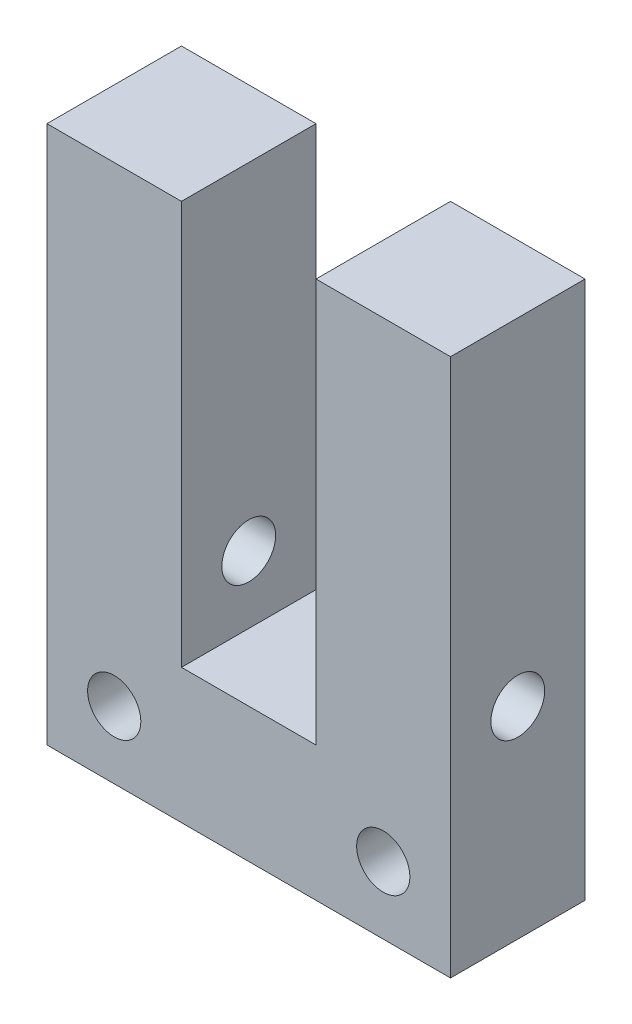
ISO-10303-21;
HEADER;
FILE_DESCRIPTION(('STEP AP214'),'2;1');
FILE_NAME('part.step','',(''),(''),'','','');
FILE_SCHEMA(('AUTOMOTIVE_DESIGN { 1 0 10303 214 1 1 1 1 }'));
ENDSEC;
DATA;
#1=APPLICATION_CONTEXT('core data for automotive mechanical design processes');
#2=APPLICATION_PROTOCOL_DEFINITION('international standard','automotive_design',2000,#1);
#3=PRODUCT_CONTEXT('',#1,'mechanical');
#4=PRODUCT('Part','Part','',(#3));
#5=PRODUCT_RELATED_PRODUCT_CATEGORY('part','',(#4));
#6=PRODUCT_DEFINITION_FORMATION('','',#4);
#7=PRODUCT_DEFINITION_CONTEXT('part definition',#1,'design');
#8=PRODUCT_DEFINITION('design','',#6,#7);
#9=PRODUCT_DEFINITION_SHAPE('','',#8);
#10=(LENGTH_UNIT() NAMED_UNIT(*) SI_UNIT(.MILLI.,.METRE.));
#11=(NAMED_UNIT(*) PLANE_ANGLE_UNIT() SI_UNIT($,.RADIAN.));
#12=(NAMED_UNIT(*) SI_UNIT($,.STERADIAN.) SOLID_ANGLE_UNIT());
#13=UNCERTAINTY_MEASURE_WITH_UNIT(LENGTH_MEASURE(1.E-05),#10,'distance_accuracy_value','');
#14=(GEOMETRIC_REPRESENTATION_CONTEXT(3) GLOBAL_UNCERTAINTY_ASSIGNED_CONTEXT((#13)) GLOBAL_UNIT_ASSIGNED_CONTEXT((#10,
#11,#12)) REPRESENTATION_CONTEXT('',''));
#15=CARTESIAN_POINT('',(0.,0.,0.));
#16=DIRECTION('',(0.,0.,1.));
#17=DIRECTION('',(1.,0.,0.));
#18=AXIS2_PLACEMENT_3D('',#15,#16,#17);
#19=CARTESIAN_POINT('',(0.,25.4,6.35));
#20=DIRECTION('',(0.,-1.,0.));
#21=DIRECTION('',(0.,0.,-1.));
#22=AXIS2_PLACEMENT_3D('',#19,#20,#21);
#23=PLANE('',#22);
#24=DIRECTION('',(-1.,0.,0.));
#25=VECTOR('',#24,1.);
#26=CARTESIAN_POINT('',(0.,25.4,6.35));
#27=LINE('',#26,#25);
#28=CARTESIAN_POINT('',(6.35,25.4,6.35));
#29=VERTEX_POINT('',#28);
#30=CARTESIAN_POINT('',(0.,25.4,6.35));
#31=VERTEX_POINT('',#30);
#32=EDGE_CURVE('E58',#29,#31,#27,.T.);
#33=ORIENTED_EDGE('',*,*,#32,.F.);
#34=DIRECTION('',(0.,0.,1.));
#35=VECTOR('',#34,1.);
#36=CARTESIAN_POINT('',(6.35,25.4,-6.35));
#37=LINE('',#36,#35);
#38=CARTESIAN_POINT('',(6.35,25.4,0.));
#39=VERTEX_POINT('',#38);
#40=EDGE_CURVE('E121',#39,#29,#37,.T.);
#41=ORIENTED_EDGE('',*,*,#40,.F.);
#42=DIRECTION('',(-1.,0.,0.));
#43=VECTOR('',#42,1.);
#44=CARTESIAN_POINT('',(0.,25.4,0.));
#45=LINE('',#44,#43);
#46=CARTESIAN_POINT('',(0.,25.4,0.));
#47=VERTEX_POINT('',#46);
#48=EDGE_CURVE('E80',#39,#47,#45,.T.);
#49=ORIENTED_EDGE('',*,*,#48,.T.);
#50=DIRECTION('',(0.,0.,-1.));
#51=VECTOR('',#50,1.);
#52=CARTESIAN_POINT('',(0.,25.4,6.35));
#53=LINE('',#52,#51);
#54=EDGE_CURVE('E144',#31,#47,#53,.T.);
#55=ORIENTED_EDGE('',*,*,#54,.F.);
#56=EDGE_LOOP('',(#33,#41,#49,#55));
#57=FACE_BOUND('',#56,.T.);
#58=ADVANCED_FACE('F32',(#57),#23,.F.);
#59=CARTESIAN_POINT('',(0.,0.,6.35));
#60=DIRECTION('',(1.,0.,0.));
#61=DIRECTION('',(0.,0.,-1.));
#62=AXIS2_PLACEMENT_3D('',#59,#60,#61);
#63=PLANE('',#62);
#64=CARTESIAN_POINT('',(0.,9.525,3.175));
#65=DIRECTION('',(-1.,0.,0.));
#66=DIRECTION('',(0.,0.,1.));
#67=AXIS2_PLACEMENT_3D('',#64,#65,#66);
#68=CIRCLE('',#67,1.27);
#69=CARTESIAN_POINT('',(0.,9.525,4.445));
#70=VERTEX_POINT('',#69);
#71=EDGE_CURVE('E231',#70,#70,#68,.T.);
#72=ORIENTED_EDGE('',*,*,#71,.F.);
#73=EDGE_LOOP('',(#72));
#74=FACE_BOUND('',#73,.T.);
#75=DIRECTION('',(0.,-1.,0.));
#76=VECTOR('',#75,1.);
#77=CARTESIAN_POINT('',(0.,0.,0.));
#78=LINE('',#77,#76);
#79=CARTESIAN_POINT('',(0.,0.,0.));
#80=VERTEX_POINT('',#79);
#81=EDGE_CURVE('E131',#47,#80,#78,.T.);
#82=ORIENTED_EDGE('',*,*,#81,.T.);
#83=DIRECTION('',(0.,0.,-1.));
#84=VECTOR('',#83,1.);
#85=CARTESIAN_POINT('',(0.,0.,6.35));
#86=LINE('',#85,#84);
#87=CARTESIAN_POINT('',(0.,0.,6.35));
#88=VERTEX_POINT('',#87);
#89=EDGE_CURVE('E160',#88,#80,#86,.T.);
#90=ORIENTED_EDGE('',*,*,#89,.F.);
#91=DIRECTION('',(0.,-1.,0.));
#92=VECTOR('',#91,1.);
#93=CARTESIAN_POINT('',(0.,0.,6.35));
#94=LINE('',#93,#92);
#95=EDGE_CURVE('E136',#31,#88,#94,.T.);
#96=ORIENTED_EDGE('',*,*,#95,.F.);
#97=ORIENTED_EDGE('',*,*,#54,.T.);
#98=EDGE_LOOP('',(#82,#90,#96,#97));
#99=FACE_BOUND('',#98,.T.);
#100=ADVANCED_FACE('F34',(#74,#99),#63,.F.);
#101=CARTESIAN_POINT('',(0.,0.,6.35));
#102=DIRECTION('',(0.,1.,0.));
#103=DIRECTION('',(0.,0.,1.));
#104=AXIS2_PLACEMENT_3D('',#101,#102,#103);
#105=PLANE('',#104);
#106=DIRECTION('',(1.,0.,0.));
#107=VECTOR('',#106,1.);
#108=CARTESIAN_POINT('',(0.,0.,0.));
#109=LINE('',#108,#107);
#110=CARTESIAN_POINT('',(19.05,0.,0.));
#111=VERTEX_POINT('',#110);
#112=EDGE_CURVE('E147',#80,#111,#109,.T.);
#113=ORIENTED_EDGE('',*,*,#112,.T.);
#114=DIRECTION('',(0.,0.,-1.));
#115=VECTOR('',#114,1.);
#116=CARTESIAN_POINT('',(19.05,0.,6.35));
#117=LINE('',#116,#115);
#118=CARTESIAN_POINT('',(19.05,0.,6.35));
#119=VERTEX_POINT('',#118);
#120=EDGE_CURVE('E157',#119,#111,#117,.T.);
#121=ORIENTED_EDGE('',*,*,#120,.F.);
#122=DIRECTION('',(1.,0.,0.));
#123=VECTOR('',#122,1.);
#124=CARTESIAN_POINT('',(0.,0.,6.35));
#125=LINE('',#124,#123);
#126=EDGE_CURVE('E88',#88,#119,#125,.T.);
#127=ORIENTED_EDGE('',*,*,#126,.F.);
#128=ORIENTED_EDGE('',*,*,#89,.T.);
#129=EDGE_LOOP('',(#113,#121,#127,#128));
#130=FACE_BOUND('',#129,.T.);
#131=ADVANCED_FACE('F186',(#130),#105,.F.);
#132=CARTESIAN_POINT('',(19.05,0.,6.35));
#133=DIRECTION('',(-1.,0.,0.));
#134=DIRECTION('',(0.,0.,1.));
#135=AXIS2_PLACEMENT_3D('',#132,#133,#134);
#136=PLANE('',#135);
#137=CARTESIAN_POINT('',(19.05,9.525,3.175));
#138=DIRECTION('',(-1.,0.,0.));
#139=DIRECTION('',(0.,0.,1.));
#140=AXIS2_PLACEMENT_3D('',#137,#138,#139);
#141=CIRCLE('',#140,1.27);
#142=CARTESIAN_POINT('',(19.05,9.525,4.445));
#143=VERTEX_POINT('',#142);
#144=EDGE_CURVE('E229',#143,#143,#141,.T.);
#145=ORIENTED_EDGE('',*,*,#144,.T.);
#146=EDGE_LOOP('',(#145));
#147=FACE_BOUND('',#146,.T.);
#148=DIRECTION('',(0.,1.,0.));
#149=VECTOR('',#148,1.);
#150=CARTESIAN_POINT('',(19.05,0.,0.));
#151=LINE('',#150,#149);
#152=CARTESIAN_POINT('',(19.05,25.4,0.));
#153=VERTEX_POINT('',#152);
#154=EDGE_CURVE('E149',#111,#153,#151,.T.);
#155=ORIENTED_EDGE('',*,*,#154,.T.);
#156=DIRECTION('',(0.,0.,-1.));
#157=VECTOR('',#156,1.);
#158=CARTESIAN_POINT('',(19.05,25.4,6.35));
#159=LINE('',#158,#157);
#160=CARTESIAN_POINT('',(19.05,25.4,6.35));
#161=VERTEX_POINT('',#160);
#162=EDGE_CURVE('E154',#161,#153,#159,.T.);
#163=ORIENTED_EDGE('',*,*,#162,.F.);
#164=DIRECTION('',(0.,1.,0.));
#165=VECTOR('',#164,1.);
#166=CARTESIAN_POINT('',(19.05,0.,6.35));
#167=LINE('',#166,#165);
#168=EDGE_CURVE('E140',#119,#161,#167,.T.);
#169=ORIENTED_EDGE('',*,*,#168,.F.);
#170=ORIENTED_EDGE('',*,*,#120,.T.);
#171=EDGE_LOOP('',(#155,#163,#169,#170));
#172=FACE_BOUND('',#171,.T.);
#173=ADVANCED_FACE('F189',(#147,#172),#136,.F.);
#174=CARTESIAN_POINT('',(12.7,25.4,0.));
#175=VERTEX_POINT('',#174);
#176=EDGE_CURVE('E138',#153,#175,#45,.T.);
#177=ORIENTED_EDGE('',*,*,#176,.T.);
#178=DIRECTION('',(0.,0.,1.));
#179=VECTOR('',#178,1.);
#180=CARTESIAN_POINT('',(12.7,25.4,-6.35));
#181=LINE('',#180,#179);
#182=CARTESIAN_POINT('',(12.7,25.4,6.35));
#183=VERTEX_POINT('',#182);
#184=EDGE_CURVE('E132',#175,#183,#181,.T.);
#185=ORIENTED_EDGE('',*,*,#184,.T.);
#186=EDGE_CURVE('E142',#161,#183,#27,.T.);
#187=ORIENTED_EDGE('',*,*,#186,.F.);
#188=ORIENTED_EDGE('',*,*,#162,.T.);
#189=EDGE_LOOP('',(#177,#185,#187,#188));
#190=FACE_BOUND('',#189,.T.);
#191=ADVANCED_FACE('F193',(#190),#23,.F.);
#192=CARTESIAN_POINT('',(0.,0.,6.35));
#193=DIRECTION('',(0.,0.,-1.));
#194=DIRECTION('',(-1.,0.,0.));
#195=AXIS2_PLACEMENT_3D('',#192,#193,#194);
#196=PLANE('',#195);
#197=CARTESIAN_POINT('',(3.175,3.175,6.35));
#198=DIRECTION('',(0.,0.,1.));
#199=DIRECTION('',(1.,0.,0.));
#200=AXIS2_PLACEMENT_3D('',#197,#198,#199);
#201=CIRCLE('',#200,1.25603);
#202=CARTESIAN_POINT('',(4.43103,3.175,6.35));
#203=VERTEX_POINT('',#202);
#204=EDGE_CURVE('E166',#203,#203,#201,.T.);
#205=ORIENTED_EDGE('',*,*,#204,.F.);
#206=EDGE_LOOP('',(#205));
#207=FACE_BOUND('',#206,.T.);
#208=CARTESIAN_POINT('',(15.875,3.175,6.35));
#209=DIRECTION('',(0.,0.,1.));
#210=DIRECTION('',(1.,0.,0.));
#211=AXIS2_PLACEMENT_3D('',#208,#209,#210);
#212=CIRCLE('',#211,1.25603);
#213=CARTESIAN_POINT('',(17.13103,3.175,6.35));
#214=VERTEX_POINT('',#213);
#215=EDGE_CURVE('E239',#214,#214,#212,.T.);
#216=ORIENTED_EDGE('',*,*,#215,.F.);
#217=EDGE_LOOP('',(#216));
#218=FACE_BOUND('',#217,.T.);
#219=DIRECTION('',(1.,0.,0.));
#220=VECTOR('',#219,1.);
#221=CARTESIAN_POINT('',(6.35,6.35,6.35));
#222=LINE('',#221,#220);
#223=CARTESIAN_POINT('',(6.35,6.35,6.35));
#224=VERTEX_POINT('',#223);
#225=CARTESIAN_POINT('',(12.7,6.35,6.35));
#226=VERTEX_POINT('',#225);
#227=EDGE_CURVE('E111',#224,#226,#222,.T.);
#228=ORIENTED_EDGE('',*,*,#227,.F.);
#229=DIRECTION('',(0.,-1.,0.));
#230=VECTOR('',#229,1.);
#231=CARTESIAN_POINT('',(6.35,6.35,6.35));
#232=LINE('',#231,#230);
#233=EDGE_CURVE('E119',#29,#224,#232,.T.);
#234=ORIENTED_EDGE('',*,*,#233,.F.);
#235=ORIENTED_EDGE('',*,*,#32,.T.);
#236=ORIENTED_EDGE('',*,*,#95,.T.);
#237=ORIENTED_EDGE('',*,*,#126,.T.);
#238=ORIENTED_EDGE('',*,*,#168,.T.);
#239=ORIENTED_EDGE('',*,*,#186,.T.);
#240=DIRECTION('',(0.,1.,0.));
#241=VECTOR('',#240,1.);
#242=CARTESIAN_POINT('',(12.7,6.35,6.35));
#243=LINE('',#242,#241);
#244=EDGE_CURVE('E117',#226,#183,#243,.T.);
#245=ORIENTED_EDGE('',*,*,#244,.F.);
#246=EDGE_LOOP('',(#228,#234,#235,#236,#237,#238,#239,#245));
#247=FACE_BOUND('',#246,.T.);
#248=ADVANCED_FACE('F124',(#207,#218,#247),#196,.F.);
#249=CARTESIAN_POINT('',(0.,0.,0.));
#250=DIRECTION('',(0.,0.,-1.));
#251=DIRECTION('',(-1.,0.,0.));
#252=AXIS2_PLACEMENT_3D('',#249,#250,#251);
#253=PLANE('',#252);
#254=CARTESIAN_POINT('',(3.175,3.175,0.));
#255=DIRECTION('',(0.,0.,-1.));
#256=DIRECTION('',(-1.,0.,0.));
#257=AXIS2_PLACEMENT_3D('',#254,#255,#256);
#258=CIRCLE('',#257,1.25603);
#259=CARTESIAN_POINT('',(1.91897,3.175,0.));
#260=VERTEX_POINT('',#259);
#261=EDGE_CURVE('E122',#260,#260,#258,.T.);
#262=ORIENTED_EDGE('',*,*,#261,.F.);
#263=EDGE_LOOP('',(#262));
#264=FACE_BOUND('',#263,.T.);
#265=CARTESIAN_POINT('',(15.875,3.175,0.));
#266=DIRECTION('',(0.,0.,-1.));
#267=DIRECTION('',(-1.,0.,0.));
#268=AXIS2_PLACEMENT_3D('',#265,#266,#267);
#269=CIRCLE('',#268,1.25603);
#270=CARTESIAN_POINT('',(14.61897,3.175,0.));
#271=VERTEX_POINT('',#270);
#272=EDGE_CURVE('E164',#271,#271,#269,.T.);
#273=ORIENTED_EDGE('',*,*,#272,.F.);
#274=EDGE_LOOP('',(#273));
#275=FACE_BOUND('',#274,.T.);
#276=DIRECTION('',(0.,1.,0.));
#277=VECTOR('',#276,1.);
#278=CARTESIAN_POINT('',(6.35,0.,0.));
#279=LINE('',#278,#277);
#280=CARTESIAN_POINT('',(6.35,6.35,0.));
#281=VERTEX_POINT('',#280);
#282=EDGE_CURVE('E11',#281,#39,#279,.T.);
#283=ORIENTED_EDGE('',*,*,#282,.F.);
#284=DIRECTION('',(-1.,0.,0.));
#285=VECTOR('',#284,1.);
#286=CARTESIAN_POINT('',(0.,6.35,0.));
#287=LINE('',#286,#285);
#288=CARTESIAN_POINT('',(12.7,6.35,0.));
#289=VERTEX_POINT('',#288);
#290=EDGE_CURVE('E114',#289,#281,#287,.T.);
#291=ORIENTED_EDGE('',*,*,#290,.F.);
#292=DIRECTION('',(0.,-1.,0.));
#293=VECTOR('',#292,1.);
#294=CARTESIAN_POINT('',(12.7,0.,0.));
#295=LINE('',#294,#293);
#296=EDGE_CURVE('E41',#175,#289,#295,.T.);
#297=ORIENTED_EDGE('',*,*,#296,.F.);
#298=ORIENTED_EDGE('',*,*,#176,.F.);
#299=ORIENTED_EDGE('',*,*,#154,.F.);
#300=ORIENTED_EDGE('',*,*,#112,.F.);
#301=ORIENTED_EDGE('',*,*,#81,.F.);
#302=ORIENTED_EDGE('',*,*,#48,.F.);
#303=EDGE_LOOP('',(#283,#291,#297,#298,#299,#300,#301,#302));
#304=FACE_BOUND('',#303,.T.);
#305=ADVANCED_FACE('F173',(#264,#275,#304),#253,.T.);
#306=CARTESIAN_POINT('',(6.35,6.35,-6.35));
#307=DIRECTION('',(-1.,0.,0.));
#308=DIRECTION('',(0.,0.,1.));
#309=AXIS2_PLACEMENT_3D('',#306,#307,#308);
#310=PLANE('',#309);
#311=CARTESIAN_POINT('',(6.35,9.525,3.175));
#312=DIRECTION('',(-1.,0.,0.));
#313=DIRECTION('',(0.,0.,1.));
#314=AXIS2_PLACEMENT_3D('',#311,#312,#313);
#315=CIRCLE('',#314,1.27);
#316=CARTESIAN_POINT('',(6.35,9.525,4.445));
#317=VERTEX_POINT('',#316);
#318=EDGE_CURVE('E233',#317,#317,#315,.T.);
#319=ORIENTED_EDGE('',*,*,#318,.T.);
#320=EDGE_LOOP('',(#319));
#321=FACE_BOUND('',#320,.T.);
#322=ORIENTED_EDGE('',*,*,#282,.T.);
#323=ORIENTED_EDGE('',*,*,#40,.T.);
#324=ORIENTED_EDGE('',*,*,#233,.T.);
#325=DIRECTION('',(0.,0.,1.));
#326=VECTOR('',#325,1.);
#327=CARTESIAN_POINT('',(6.35,6.35,-6.35));
#328=LINE('',#327,#326);
#329=EDGE_CURVE('E107',#281,#224,#328,.T.);
#330=ORIENTED_EDGE('',*,*,#329,.F.);
#331=EDGE_LOOP('',(#322,#323,#324,#330));
#332=FACE_BOUND('',#331,.T.);
#333=ADVANCED_FACE('F120',(#321,#332),#310,.F.);
#334=CARTESIAN_POINT('',(12.7,6.35,-6.35));
#335=DIRECTION('',(1.,0.,0.));
#336=DIRECTION('',(0.,0.,-1.));
#337=AXIS2_PLACEMENT_3D('',#334,#335,#336);
#338=PLANE('',#337);
#339=CARTESIAN_POINT('',(12.7,9.525,3.175));
#340=DIRECTION('',(1.,0.,0.));
#341=DIRECTION('',(0.,0.,-1.));
#342=AXIS2_PLACEMENT_3D('',#339,#340,#341);
#343=CIRCLE('',#342,1.27);
#344=CARTESIAN_POINT('',(12.7,9.525,1.905));
#345=VERTEX_POINT('',#344);
#346=EDGE_CURVE('E36',#345,#345,#343,.T.);
#347=ORIENTED_EDGE('',*,*,#346,.T.);
#348=EDGE_LOOP('',(#347));
#349=FACE_BOUND('',#348,.T.);
#350=ORIENTED_EDGE('',*,*,#296,.T.);
#351=DIRECTION('',(0.,0.,1.));
#352=VECTOR('',#351,1.);
#353=CARTESIAN_POINT('',(12.7,6.35,-6.35));
#354=LINE('',#353,#352);
#355=EDGE_CURVE('E49',#289,#226,#354,.T.);
#356=ORIENTED_EDGE('',*,*,#355,.T.);
#357=ORIENTED_EDGE('',*,*,#244,.T.);
#358=ORIENTED_EDGE('',*,*,#184,.F.);
#359=EDGE_LOOP('',(#350,#356,#357,#358));
#360=FACE_BOUND('',#359,.T.);
#361=ADVANCED_FACE('F195',(#349,#360),#338,.F.);
#362=CARTESIAN_POINT('',(6.35,6.35,-6.35));
#363=DIRECTION('',(0.,-1.,0.));
#364=DIRECTION('',(0.,0.,-1.));
#365=AXIS2_PLACEMENT_3D('',#362,#363,#364);
#366=PLANE('',#365);
#367=ORIENTED_EDGE('',*,*,#290,.T.);
#368=ORIENTED_EDGE('',*,*,#329,.T.);
#369=ORIENTED_EDGE('',*,*,#227,.T.);
#370=ORIENTED_EDGE('',*,*,#355,.F.);
#371=EDGE_LOOP('',(#367,#368,#369,#370));
#372=FACE_BOUND('',#371,.T.);
#373=ADVANCED_FACE('F109',(#372),#366,.F.);
#374=CARTESIAN_POINT('',(15.875,3.175,-6.35));
#375=DIRECTION('',(0.,0.,1.));
#376=DIRECTION('',(1.,0.,0.));
#377=AXIS2_PLACEMENT_3D('',#374,#375,#376);
#378=CYLINDRICAL_SURFACE('',#377,1.25603);
#379=ORIENTED_EDGE('',*,*,#272,.T.);
#380=EDGE_LOOP('',(#379));
#381=FACE_BOUND('',#380,.T.);
#382=ORIENTED_EDGE('',*,*,#215,.T.);
#383=EDGE_LOOP('',(#382));
#384=FACE_BOUND('',#383,.T.);
#385=ADVANCED_FACE('F203',(#381,#384),#378,.F.);
#386=CARTESIAN_POINT('',(3.175,3.175,-6.35));
#387=DIRECTION('',(0.,0.,1.));
#388=DIRECTION('',(1.,0.,0.));
#389=AXIS2_PLACEMENT_3D('',#386,#387,#388);
#390=CYLINDRICAL_SURFACE('',#389,1.25603);
#391=ORIENTED_EDGE('',*,*,#261,.T.);
#392=EDGE_LOOP('',(#391));
#393=FACE_BOUND('',#392,.T.);
#394=ORIENTED_EDGE('',*,*,#204,.T.);
#395=EDGE_LOOP('',(#394));
#396=FACE_BOUND('',#395,.T.);
#397=ADVANCED_FACE('F170',(#393,#396),#390,.F.);
#398=CARTESIAN_POINT('',(19.05,9.525,3.175));
#399=DIRECTION('',(-1.,0.,0.));
#400=DIRECTION('',(0.,0.,1.));
#401=AXIS2_PLACEMENT_3D('',#398,#399,#400);
#402=CYLINDRICAL_SURFACE('',#401,1.27);
#403=ORIENTED_EDGE('',*,*,#144,.F.);
#404=EDGE_LOOP('',(#403));
#405=FACE_BOUND('',#404,.T.);
#406=ORIENTED_EDGE('',*,*,#346,.F.);
#407=EDGE_LOOP('',(#406));
#408=FACE_BOUND('',#407,.T.);
#409=ADVANCED_FACE('F250',(#405,#408),#402,.F.);
#410=ORIENTED_EDGE('',*,*,#71,.T.);
#411=EDGE_LOOP('',(#410));
#412=FACE_BOUND('',#411,.T.);
#413=ORIENTED_EDGE('',*,*,#318,.F.);
#414=EDGE_LOOP('',(#413));
#415=FACE_BOUND('',#414,.T.);
#416=ADVANCED_FACE('F253',(#412,#415),#402,.F.);
#417=CLOSED_SHELL('',(#58,#100,#131,#173,#191,#248,#305,#333,#361,#373,#385,#397,#409,#416));
#418=MANIFOLD_SOLID_BREP('B2',#417);
#419=ADVANCED_BREP_SHAPE_REPRESENTATION('',(#18,#418),#14);
#420=SHAPE_DEFINITION_REPRESENTATION(#9,#419);
ENDSEC;
END-ISO-10303-21;
